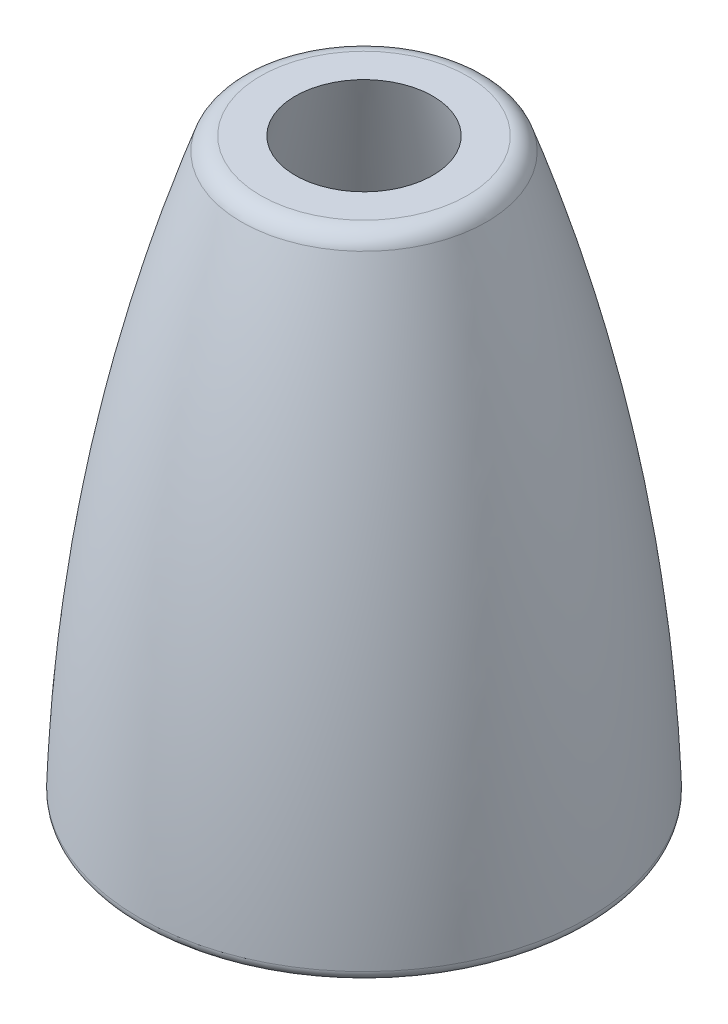
ISO-10303-21;
HEADER;
FILE_DESCRIPTION(('STEP AP214'),'2;1');
FILE_NAME('part.step','',(''),(''),'','','');
FILE_SCHEMA(('AUTOMOTIVE_DESIGN { 1 0 10303 214 1 1 1 1 }'));
ENDSEC;
DATA;
#1=APPLICATION_CONTEXT('core data for automotive mechanical design processes');
#2=APPLICATION_PROTOCOL_DEFINITION('international standard','automotive_design',2000,#1);
#3=PRODUCT_CONTEXT('',#1,'mechanical');
#4=PRODUCT('Part','Part','',(#3));
#5=PRODUCT_RELATED_PRODUCT_CATEGORY('part','',(#4));
#6=PRODUCT_DEFINITION_FORMATION('','',#4);
#7=PRODUCT_DEFINITION_CONTEXT('part definition',#1,'design');
#8=PRODUCT_DEFINITION('design','',#6,#7);
#9=PRODUCT_DEFINITION_SHAPE('','',#8);
#10=(LENGTH_UNIT() NAMED_UNIT(*) SI_UNIT(.MILLI.,.METRE.));
#11=(NAMED_UNIT(*) PLANE_ANGLE_UNIT() SI_UNIT($,.RADIAN.));
#12=(NAMED_UNIT(*) SI_UNIT($,.STERADIAN.) SOLID_ANGLE_UNIT());
#13=UNCERTAINTY_MEASURE_WITH_UNIT(LENGTH_MEASURE(1.E-05),#10,'distance_accuracy_value','');
#14=(GEOMETRIC_REPRESENTATION_CONTEXT(3) GLOBAL_UNCERTAINTY_ASSIGNED_CONTEXT((#13)) GLOBAL_UNIT_ASSIGNED_CONTEXT((#10,
#11,#12)) REPRESENTATION_CONTEXT('',''));
#15=CARTESIAN_POINT('',(0.,0.,0.));
#16=DIRECTION('',(0.,0.,1.));
#17=DIRECTION('',(1.,0.,0.));
#18=AXIS2_PLACEMENT_3D('',#15,#16,#17);
#19=CARTESIAN_POINT('',(0.,15.2,0.));
#20=DIRECTION('',(0.,-1.,0.));
#21=DIRECTION('',(0.,0.,-1.));
#22=AXIS2_PLACEMENT_3D('',#19,#20,#21);
#23=PLANE('',#22);
#24=DIRECTION('',(-0.00914718851659997,0.,0.999958163595979));
#25=VECTOR('',#24,1.);
#26=CARTESIAN_POINT('',(5.6,15.2,0.));
#27=LINE('',#26,#25);
#28=CARTESIAN_POINT('',(5.6,15.2,0.));
#29=VERTEX_POINT('',#28);
#30=CARTESIAN_POINT('',(5.59906288415433,15.2,0.102444225175011));
#31=VERTEX_POINT('',#30);
#32=EDGE_CURVE('E62',#29,#31,#27,.T.);
#33=ORIENTED_EDGE('',*,*,#32,.T.);
#34=CARTESIAN_POINT('',(0.,15.2,0.));
#35=DIRECTION('',(0.,-1.,0.));
#36=DIRECTION('',(0.,0.,-1.));
#37=AXIS2_PLACEMENT_3D('',#34,#35,#36);
#38=CIRCLE('',#37,5.59999999999999);
#39=CARTESIAN_POINT('',(-5.6,15.2,0.));
#40=VERTEX_POINT('',#39);
#41=EDGE_CURVE('E59',#31,#40,#38,.T.);
#42=ORIENTED_EDGE('',*,*,#41,.T.);
#43=DIRECTION('',(0.00919737743597815,0.,-0.999957703229642));
#44=VECTOR('',#43,1.);
#45=CARTESIAN_POINT('',(-5.6,15.2,0.));
#46=LINE('',#45,#44);
#47=CARTESIAN_POINT('',(-5.59906031348,15.2,-0.102444178140847));
#48=VERTEX_POINT('',#47);
#49=EDGE_CURVE('E19',#40,#48,#46,.T.);
#50=ORIENTED_EDGE('',*,*,#49,.T.);
#51=CARTESIAN_POINT('',(0.,15.2,0.));
#52=DIRECTION('',(0.,-1.,0.));
#53=DIRECTION('',(0.,0.,-1.));
#54=AXIS2_PLACEMENT_3D('',#51,#52,#53);
#55=CIRCLE('',#54,5.59999999999999);
#56=EDGE_CURVE('E57',#48,#29,#55,.T.);
#57=ORIENTED_EDGE('',*,*,#56,.T.);
#58=EDGE_LOOP('',(#33,#42,#50,#57));
#59=FACE_BOUND('',#58,.T.);
#60=CARTESIAN_POINT('',(0.,15.2,0.));
#61=DIRECTION('',(0.,-1.,0.));
#62=DIRECTION('',(0.,0.,-1.));
#63=AXIS2_PLACEMENT_3D('',#60,#61,#62);
#64=CIRCLE('',#63,3.525);
#65=CARTESIAN_POINT('',(0.,15.2,-3.525));
#66=VERTEX_POINT('',#65);
#67=EDGE_CURVE('E60',#66,#66,#64,.F.);
#68=ORIENTED_EDGE('',*,*,#67,.T.);
#69=EDGE_LOOP('',(#68));
#70=FACE_BOUND('',#69,.T.);
#71=ADVANCED_FACE('F15',(#59,#70),#23,.T.);
#72=CARTESIAN_POINT('',(0.,29.38420303264,0.));
#73=DIRECTION('',(0.,-1.,0.));
#74=DIRECTION('',(0.,0.,-1.));
#75=AXIS2_PLACEMENT_3D('',#72,#73,#74);
#76=CYLINDRICAL_SURFACE('',#75,3.525);
#77=ORIENTED_EDGE('',*,*,#67,.F.);
#78=EDGE_LOOP('',(#77));
#79=FACE_BOUND('',#78,.T.);
#80=CARTESIAN_POINT('',(0.,24.,0.));
#81=DIRECTION('',(0.,-1.,0.));
#82=DIRECTION('',(0.,0.,-1.));
#83=AXIS2_PLACEMENT_3D('',#80,#81,#82);
#84=CIRCLE('',#83,3.525);
#85=CARTESIAN_POINT('',(0.,24.,-3.525));
#86=VERTEX_POINT('',#85);
#87=EDGE_CURVE('E68',#86,#86,#84,.F.);
#88=ORIENTED_EDGE('',*,*,#87,.T.);
#89=EDGE_LOOP('',(#88));
#90=FACE_BOUND('',#89,.T.);
#91=ADVANCED_FACE('F157',(#79,#90),#76,.F.);
#92=CARTESIAN_POINT('',(0.,13.2,0.));
#93=DIRECTION('',(0.,-1.,0.));
#94=DIRECTION('',(0.,0.,-1.));
#95=AXIS2_PLACEMENT_3D('',#92,#93,#94);
#96=TOROIDAL_SURFACE('',#95,5.60000000000001,2.);
#97=CARTESIAN_POINT('',(0.,13.2,0.));
#98=DIRECTION('',(0.,-1.,0.));
#99=DIRECTION('',(0.,0.,-1.));
#100=AXIS2_PLACEMENT_3D('',#97,#98,#99);
#101=CIRCLE('',#100,7.6);
#102=CARTESIAN_POINT('',(0.,13.2,-7.6));
#103=VERTEX_POINT('',#102);
#104=EDGE_CURVE('E71',#103,#103,#101,.T.);
#105=ORIENTED_EDGE('',*,*,#104,.T.);
#106=EDGE_LOOP('',(#105));
#107=FACE_BOUND('',#106,.T.);
#108=ORIENTED_EDGE('',*,*,#56,.F.);
#109=ORIENTED_EDGE('',*,*,#49,.F.);
#110=ORIENTED_EDGE('',*,*,#41,.F.);
#111=ORIENTED_EDGE('',*,*,#32,.F.);
#112=EDGE_LOOP('',(#108,#109,#110,#111));
#113=FACE_BOUND('',#112,.T.);
#114=ADVANCED_FACE('F61',(#107,#113),#96,.F.);
#115=CARTESIAN_POINT('',(0.,24.,0.));
#116=DIRECTION('',(0.,-1.,0.));
#117=DIRECTION('',(0.,0.,-1.));
#118=AXIS2_PLACEMENT_3D('',#115,#116,#117);
#119=PLANE('',#118);
#120=CARTESIAN_POINT('',(0.,24.,0.));
#121=DIRECTION('',(0.,-1.,0.));
#122=DIRECTION('',(0.,0.,-1.));
#123=AXIS2_PLACEMENT_3D('',#120,#121,#122);
#124=CIRCLE('',#123,5.025);
#125=CARTESIAN_POINT('',(0.,24.,-5.025));
#126=VERTEX_POINT('',#125);
#127=EDGE_CURVE('E72',#126,#126,#124,.F.);
#128=ORIENTED_EDGE('',*,*,#127,.T.);
#129=EDGE_LOOP('',(#128));
#130=FACE_BOUND('',#129,.T.);
#131=ORIENTED_EDGE('',*,*,#87,.F.);
#132=EDGE_LOOP('',(#131));
#133=FACE_BOUND('',#132,.T.);
#134=ADVANCED_FACE('F152',(#130,#133),#119,.F.);
#135=CARTESIAN_POINT('',(0.,29.38420303264,0.));
#136=DIRECTION('',(0.,-1.,0.));
#137=DIRECTION('',(0.,0.,-1.));
#138=AXIS2_PLACEMENT_3D('',#135,#136,#137);
#139=CYLINDRICAL_SURFACE('',#138,7.6);
#140=ORIENTED_EDGE('',*,*,#104,.F.);
#141=EDGE_LOOP('',(#140));
#142=FACE_BOUND('',#141,.T.);
#143=CARTESIAN_POINT('',(0.,2.4,0.));
#144=DIRECTION('',(0.,-1.,0.));
#145=DIRECTION('',(0.,0.,-1.));
#146=AXIS2_PLACEMENT_3D('',#143,#144,#145);
#147=CIRCLE('',#146,7.6);
#148=CARTESIAN_POINT('',(0.,2.4,-7.6));
#149=VERTEX_POINT('',#148);
#150=EDGE_CURVE('E75',#149,#149,#147,.F.);
#151=ORIENTED_EDGE('',*,*,#150,.F.);
#152=EDGE_LOOP('',(#151));
#153=FACE_BOUND('',#152,.T.);
#154=ADVANCED_FACE('F148',(#142,#153),#139,.F.);
#155=CARTESIAN_POINT('',(0.,29.38420303264,0.));
#156=DIRECTION('',(0.,-1.,0.));
#157=DIRECTION('',(0.,0.,-1.));
#158=AXIS2_PLACEMENT_3D('',#155,#156,#157);
#159=CYLINDRICAL_SURFACE('',#158,5.025);
#160=ORIENTED_EDGE('',*,*,#127,.F.);
#161=EDGE_LOOP('',(#160));
#162=FACE_BOUND('',#161,.T.);
#163=CARTESIAN_POINT('',(0.,25.0000000000909,0.));
#164=DIRECTION('',(0.,-1.,0.));
#165=DIRECTION('',(0.,0.,-1.));
#166=AXIS2_PLACEMENT_3D('',#163,#164,#165);
#167=CIRCLE('',#166,5.02499999998918);
#168=CARTESIAN_POINT('',(0.,25.0000000000909,-5.02499999998918));
#169=VERTEX_POINT('',#168);
#170=EDGE_CURVE('E78',#169,#169,#167,.F.);
#171=ORIENTED_EDGE('',*,*,#170,.T.);
#172=EDGE_LOOP('',(#171));
#173=FACE_BOUND('',#172,.T.);
#174=ADVANCED_FACE('F132',(#162,#173),#159,.F.);
#175=CARTESIAN_POINT('',(0.,2.4,-21.5));
#176=DIRECTION('',(0.,-1.,0.));
#177=DIRECTION('',(0.,0.,-1.));
#178=AXIS2_PLACEMENT_3D('',#175,#176,#177);
#179=PLANE('',#178);
#180=CARTESIAN_POINT('',(-3.03576608295941E-13,2.4,2.87725843584746E-11));
#181=DIRECTION('',(0.,1.,0.));
#182=DIRECTION('',(0.,0.,1.));
#183=AXIS2_PLACEMENT_3D('',#180,#181,#182);
#184=CIRCLE('',#183,10.6542866382603);
#185=CARTESIAN_POINT('',(10.6536899184604,2.40000000000429,0.112621861908318));
#186=VERTEX_POINT('',#185);
#187=CARTESIAN_POINT('',(-10.65428663826,2.4,0.));
#188=VERTEX_POINT('',#187);
#189=EDGE_CURVE('E79',#186,#188,#184,.T.);
#190=ORIENTED_EDGE('',*,*,#189,.F.);
#191=CARTESIAN_POINT('',(-10.65428663826,2.4,0.));
#192=CARTESIAN_POINT('',(-10.6542689654252,2.39999999830858,0.143919287529837));
#193=CARTESIAN_POINT('',(-10.6513574592582,2.39999999773107,0.287843408679064));
#194=CARTESIAN_POINT('',(-10.6397446924835,2.40000000255313,0.575452835882171));
#195=CARTESIAN_POINT('',(-10.6310436312798,2.40000000795251,0.719138149990188));
#196=CARTESIAN_POINT('',(-10.6107488432834,2.40000002591153,0.970170610886358));
#197=CARTESIAN_POINT('',(-10.6004220566456,2.4000000363437,1.07762217602543));
#198=CARTESIAN_POINT('',(-10.5765691163456,2.40000014385088,1.29217199450075));
#199=CARTESIAN_POINT('',(-10.5630430012679,2.40000024092485,1.39927025208218));
#200=CARTESIAN_POINT('',(-10.535752312596,2.40000030857561,1.59092289349643));
#201=CARTESIAN_POINT('',(-10.5226133248162,2.40000030112809,1.67556731398593));
#202=CARTESIAN_POINT('',(-10.4810718321089,2.40000024267947,1.92321301128468));
#203=CARTESIAN_POINT('',(-10.4498527563828,2.4000001575678,2.08575152538939));
#204=CARTESIAN_POINT('',(-10.3846237503688,2.40000005228976,2.38727630128094));
#205=CARTESIAN_POINT('',(-10.3515649659946,2.40000002488674,2.52647001874884));
#206=CARTESIAN_POINT('',(-10.2883486349572,2.40000000196427,2.77073014982354));
#207=CARTESIAN_POINT('',(-10.2593480934118,2.40000000044585,2.8760969424706));
#208=CARTESIAN_POINT('',(-10.2032715490783,2.39999999962856,3.068392670818));
#209=CARTESIAN_POINT('',(-10.1766822462099,2.40000000000152,3.15546366099328));
#210=CARTESIAN_POINT('',(-10.1212742313736,2.40000000053643,3.32889135840802));
#211=CARTESIAN_POINT('',(-10.0924555225762,2.40000000069838,3.41524806666308));
#212=CARTESIAN_POINT('',(-10.0026970386529,2.40000000135446,3.67316629896762));
#213=CARTESIAN_POINT('',(-9.93845063392781,2.40000000201884,3.84359058201102));
#214=CARTESIAN_POINT('',(-9.80131387731575,2.40000000307656,4.18091500733054));
#215=CARTESIAN_POINT('',(-9.72842353771891,2.4000000034699,4.34781515461696));
#216=CARTESIAN_POINT('',(-9.57418876683898,2.40000000386674,4.67766494088835));
#217=CARTESIAN_POINT('',(-9.49284433955938,2.40000000387024,4.84061458174408));
#218=CARTESIAN_POINT('',(-9.32191540324746,2.40000000346465,5.16213249971454));
#219=CARTESIAN_POINT('',(-9.23233089030359,2.40000000305557,5.32070077474941));
#220=CARTESIAN_POINT('',(-9.04515641883491,2.40000000203542,5.63304070655637));
#221=CARTESIAN_POINT('',(-8.94756644891892,2.40000000142435,5.78681235650279));
#222=CARTESIAN_POINT('',(-8.74463865936752,2.40000000040542,6.08915477896542));
#223=CARTESIAN_POINT('',(-8.63930082136096,2.39999999999756,6.23772553914845));
#224=CARTESIAN_POINT('',(-8.41020711726413,2.40000000000269,6.54390032354204));
#225=CARTESIAN_POINT('',(-8.28566366259152,2.40000000050213,6.70091550779718));
#226=CARTESIAN_POINT('',(-8.0245635434954,2.4000000020686,7.01166508144463));
#227=CARTESIAN_POINT('',(-7.88777887686231,2.40000000315004,7.16520833740024));
#228=CARTESIAN_POINT('',(-7.67479101851897,2.40000000494652,7.39079700050716));
#229=CARTESIAN_POINT('',(-7.60177810882471,2.40000000558113,7.4658794371768));
#230=CARTESIAN_POINT('',(-7.4526470609581,2.4000000068793,7.61478060303627));
#231=CARTESIAN_POINT('',(-7.37650161345749,2.40000000754313,7.68857204267664));
#232=CARTESIAN_POINT('',(-7.2210945686466,2.40000000886775,7.83473956862671));
#233=CARTESIAN_POINT('',(-7.14180619840818,2.40000000952841,7.90708717467028));
#234=CARTESIAN_POINT('',(-6.9801049225498,2.40000001081896,8.05021586278085));
#235=CARTESIAN_POINT('',(-6.89766579162835,2.40000001144838,8.12096732297199));
#236=CARTESIAN_POINT('',(-6.72966198850291,2.4000000126523,8.26074781647359));
#237=CARTESIAN_POINT('',(-6.64407170732765,2.40000001322605,8.32974607068237));
#238=CARTESIAN_POINT('',(-6.4697710814335,2.40000001429818,8.4658611868031));
#239=CARTESIAN_POINT('',(-6.38103579891656,2.4000000147956,8.53294611727492));
#240=CARTESIAN_POINT('',(-6.20045780221209,2.40000001569834,8.66507237939187));
#241=CARTESIAN_POINT('',(-6.10859088151632,2.40000001610253,8.73008062982968));
#242=CARTESIAN_POINT('',(-5.92176963588495,2.40000001680581,8.85788843957988));
#243=CARTESIAN_POINT('',(-5.82679189585519,2.40000001710363,8.92065377447998));
#244=CARTESIAN_POINT('',(-5.63377678980184,2.40000001758488,9.04380801520357));
#245=CARTESIAN_POINT('',(-5.53571686153046,2.40000001776696,9.10416156241783));
#246=CARTESIAN_POINT('',(-5.33657322732413,2.40000001801114,9.22232214694561));
#247=CARTESIAN_POINT('',(-5.23546787424722,2.40000001807186,9.28009270347657));
#248=CARTESIAN_POINT('',(-5.03027763116661,2.40000001807147,9.39291520059263));
#249=CARTESIAN_POINT('',(-4.92617207220108,2.40000001800899,9.4479295532585));
#250=CARTESIAN_POINT('',(-4.71503436328771,2.40000001776403,9.55506585758364));
#251=CARTESIAN_POINT('',(-4.60798258629679,2.40000001758024,9.60714913238561));
#252=CARTESIAN_POINT('',(-4.39101439717269,2.40000001709826,9.70824818850018));
#253=CARTESIAN_POINT('',(-4.28107946419287,2.40000001679883,9.75722422548242));
#254=CARTESIAN_POINT('',(-4.05841622285273,2.40000001609488,9.85193280435814));
#255=CARTESIAN_POINT('',(-3.94567056451431,2.40000001568925,9.89762455929158));
#256=CARTESIAN_POINT('',(-3.71746671809562,2.40000001478591,9.98558808839484));
#257=CARTESIAN_POINT('',(-3.60199241582189,2.40000001428727,10.0278180613017));
#258=CARTESIAN_POINT('',(-3.36842198050451,2.40000001321465,10.1086815085291));
#259=CARTESIAN_POINT('',(-3.25031103404552,2.40000001263994,10.1472721991937));
#260=CARTESIAN_POINT('',(-3.01156811569287,2.40000001143568,10.2206810111957));
#261=CARTESIAN_POINT('',(-2.89092269607751,2.40000001080561,10.2554554020755));
#262=CARTESIAN_POINT('',(-2.64722197223107,2.40000000951486,10.3210564959765));
#263=CARTESIAN_POINT('',(-2.52415465056554,2.40000000885391,10.3518385610883));
#264=CARTESIAN_POINT('',(-2.27573183046901,2.40000000752934,10.409281373211));
#265=CARTESIAN_POINT('',(-2.1503658092037,2.40000000686575,10.4358966180933));
#266=CARTESIAN_POINT('',(-1.8974779890401,2.40000000556757,10.4848341948264));
#267=CARTESIAN_POINT('',(-1.76994722486463,2.40000000493334,10.5071102073588));
#268=CARTESIAN_POINT('',(-1.51287343186185,2.40000000372925,10.5472003921));
#269=CARTESIAN_POINT('',(-1.3833230599813,2.40000000316012,10.5649674792923));
#270=CARTESIAN_POINT('',(-1.12236385196942,2.40000000212543,10.5958739874785));
#271=CARTESIAN_POINT('',(-0.990949348874298,2.40000000166097,10.608965611514));
#272=CARTESIAN_POINT('',(-0.726429741988141,2.40000000087828,10.6303597767161));
#273=CARTESIAN_POINT('',(-0.593320736252382,2.40000000056154,10.638613873501));
#274=CARTESIAN_POINT('',(-0.32558025454125,2.4000000001218,10.6501740923384));
#275=CARTESIAN_POINT('',(-0.190946592522561,2.40000000000072,10.6534311662041));
#276=CARTESIAN_POINT('',(-0.0470284588738655,2.39999999999995,10.6541865442615));
#277=CARTESIAN_POINT('',(-0.0377444618552427,2.40000000000047,10.6542231453236));
#278=CARTESIAN_POINT('',(-0.0189736752545771,2.40000000000061,10.654273174296));
#279=CARTESIAN_POINT('',(-0.00948688460339239,2.4000000000002,10.6542860786969));
#280=CARTESIAN_POINT('',(0.191013888883362,2.39999999999809,10.6542910328116));
#281=CARTESIAN_POINT('',(0.382065865956335,2.40000000011982,10.6491593505252));
#282=CARTESIAN_POINT('',(0.763596773054154,2.40000000056937,10.6286303474993));
#283=CARTESIAN_POINT('',(0.954075702099103,2.40000000089718,10.6132330092158));
#284=CARTESIAN_POINT('',(1.34128028737617,2.40000000172442,10.5714259642177));
#285=CARTESIAN_POINT('',(1.53796279719374,2.40000000222999,10.5446135831903));
#286=CARTESIAN_POINT('',(1.92952143768506,2.40000000336103,10.4800470497553));
#287=CARTESIAN_POINT('',(2.12439756563847,2.40000000398649,10.4422928808724));
#288=CARTESIAN_POINT('',(2.51173827947328,2.40000000531231,10.3559606841277));
#289=CARTESIAN_POINT('',(2.70420286205415,2.40000000601268,10.3073826414536));
#290=CARTESIAN_POINT('',(3.08611894087873,2.40000000744787,10.1995542580399));
#291=CARTESIAN_POINT('',(3.27557043341227,2.40000000818269,10.14030390416));
#292=CARTESIAN_POINT('',(3.6508692382591,2.40000000965055,10.0113158094691));
#293=CARTESIAN_POINT('',(3.83671654662911,2.40000001038358,9.94157805718461));
#294=CARTESIAN_POINT('',(4.20422685751157,2.4000000118159,9.79183280306576));
#295=CARTESIAN_POINT('',(4.38588985602035,2.40000001251518,9.71182529140541));
#296=CARTESIAN_POINT('',(4.74446455646986,2.40000001385233,9.54179021538459));
#297=CARTESIAN_POINT('',(4.9213762545165,2.4000000144902,9.45176264281212));
#298=CARTESIAN_POINT('',(5.26989617296175,2.4000000156811,9.26196841850885));
#299=CARTESIAN_POINT('',(5.44150438974156,2.40000001623413,9.16220176013281));
#300=CARTESIAN_POINT('',(5.77888172351382,2.40000001723625,8.95324073829535));
#301=CARTESIAN_POINT('',(5.94465083732331,2.40000001768533,8.84404636969491));
#302=CARTESIAN_POINT('',(6.26983256719389,2.40000001846469,8.61657072979846));
#303=CARTESIAN_POINT('',(6.4292451806623,2.40000001879496,8.49828945479618));
#304=CARTESIAN_POINT('',(6.74121635308807,2.40000001932612,8.25300916901855));
#305=CARTESIAN_POINT('',(6.89377491019043,2.40000001952701,8.12601015588383));
#306=CARTESIAN_POINT('',(7.19156180707351,2.40000001979311,7.86369077287557));
#307=CARTESIAN_POINT('',(7.33679014587629,2.40000001985832,7.72837040189188));
#308=CARTESIAN_POINT('',(7.61946332388734,2.40000001985103,7.44983065697628));
#309=CARTESIAN_POINT('',(7.75690816312532,2.40000001977853,7.30661128307452));
#310=CARTESIAN_POINT('',(8.02358535526072,2.40000001949807,7.01272054241503));
#311=CARTESIAN_POINT('',(8.15281770931649,2.40000001929011,6.86204917670838));
#312=CARTESIAN_POINT('',(8.40266657904466,2.40000001874527,6.55372472340272));
#313=CARTESIAN_POINT('',(8.52328309711465,2.40000001840838,6.39607163774658));
#314=CARTESIAN_POINT('',(8.75552383669356,2.40000001761648,6.07427580832816));
#315=CARTESIAN_POINT('',(8.86714806193882,2.40000001716147,5.9101330672624));
#316=CARTESIAN_POINT('',(9.08105582665245,2.4000000161484,5.57587024754151));
#317=CARTESIAN_POINT('',(9.18333937128372,2.40000001559034,5.40575017219033));
#318=CARTESIAN_POINT('',(9.37824654237508,2.40000001439053,5.06006366184002));
#319=CARTESIAN_POINT('',(9.47087017550015,2.40000001374878,4.88449723059878));
#320=CARTESIAN_POINT('',(9.64616844336396,2.40000001240522,4.52846598618357));
#321=CARTESIAN_POINT('',(9.72884308633243,2.4000000117034,4.34800117706165));
#322=CARTESIAN_POINT('',(9.88398535257184,2.40000001026762,3.98273644401866));
#323=CARTESIAN_POINT('',(9.95645298568663,2.40000000953366,3.79793652427867));
#324=CARTESIAN_POINT('',(10.0909550590335,2.40000000806575,3.42457836709743));
#325=CARTESIAN_POINT('',(10.1529895107593,2.40000000733181,3.23602013379679));
#326=CARTESIAN_POINT('',(10.2664316627028,2.40000000590042,2.85573387996979));
#327=CARTESIAN_POINT('',(10.3178393760859,2.40000000520297,2.66400586337074));
#328=CARTESIAN_POINT('',(10.4098674858571,2.40000000388528,2.27797845453466));
#329=CARTESIAN_POINT('',(10.4504878970899,2.40000000326503,2.08367906583651));
#330=CARTESIAN_POINT('',(10.52081517327,2.40000000214683,1.69311539349087));
#331=CARTESIAN_POINT('',(10.5505220547331,2.40000000164886,1.49685111281741));
#332=CARTESIAN_POINT('',(10.5989276302434,2.40000000082426,1.10297010376945));
#333=CARTESIAN_POINT('',(10.6176263424604,2.40000000049763,0.905353377627839));
#334=CARTESIAN_POINT('',(10.6439645479174,2.40000000007014,0.509384760559068));
#335=CARTESIAN_POINT('',(10.6516040609293,2.3999999999693,0.311032870946887));
#336=CARTESIAN_POINT('',(10.6536884539806,2.40000000000858,0.112621846399577));
#337=B_SPLINE_CURVE_WITH_KNOTS('',3,(#191,#192,#193,#194,#195,#196,#197,#198,#199,#200,#201,
#202,#203,#204,#205,#206,#207,#208,#209,#210,#211,#212,#213,#214,#215,#216,#217,#218,#219,#220,
#221,#222,#223,#224,#225,#226,#227,#228,#229,#230,#231,#232,#233,#234,#235,#236,#237,#238,#239,
#240,#241,#242,#243,#244,#245,#246,#247,#248,#249,#250,#251,#252,#253,#254,#255,#256,#257,#258,
#259,#260,#261,#262,#263,#264,#265,#266,#267,#268,#269,#270,#271,#272,#273,#274,#275,#276,#277,
#278,#279,#280,#281,#282,#283,#284,#285,#286,#287,#288,#289,#290,#291,#292,#293,#294,#295,#296,
#297,#298,#299,#300,#301,#302,#303,#304,#305,#306,#307,#308,#309,#310,#311,#312,#313,#314,#315,
#316,#317,#318,#319,#320,#321,#322,#323,#324,#325,#326,#327,#328,#329,#330,#331,#332,#333,#334,
#335,#336),.UNSPECIFIED.,.F.,.F.,(4,2,2,2,2,2,2,2,2,2,2,2,2,2,2,2,2,2,2,2,2,2,2,2,2,2,2,2,2,2,2,
2,2,2,2,2,2,2,2,2,2,2,2,2,2,2,2,2,2,2,2,2,2,2,2,2,2,2,2,2,2,2,2,2,2,2,2,2,2,2,2,2,4),(0.,
0.431738984942221,0.863463100688874,1.18725872471448,1.51105044388004,1.7680036281368,
2.26433094141186,2.69341494362834,3.02121974758522,3.29431064740003,3.56740115885592,
4.11353645101099,4.65967096666832,5.20580522370128,5.75193973998333,6.29807503338784,
6.84421162178822,7.44513204955969,8.06166015323436,8.37581105823764,8.69386495801826,
9.01582180951017,9.34168156800898,9.67144418717206,10.0051096190185,10.3426778139291,
10.6841487206466,11.0295222862753,11.3787984562814,11.7319771744931,12.0890583831002,
12.4500420226545,12.8149280320698,13.1837163486214,13.556406907947,13.9329996440459,
14.3134944892794,14.697891374371,15.0861902284058,15.4783909788312,15.8744935514566,
16.2744978704531,16.6784038583544,16.706256088868,16.7347165554273,17.307754451861,
17.8807933276188,18.4759829075216,19.0711733836132,19.6663646742154,20.2615566976498,
20.8567493722382,21.4519426163022,22.0471363481634,22.6423304861438,23.2375249485648,
23.8327196537482,24.4279145200158,25.0231094656892,25.6183044090901,26.2134992685402,
26.8086939623612,27.4038884088748,27.9990825264027,28.5942762332667,29.1894694477883,
29.7846620882893,30.3798540730915,30.9750453205164,31.5702357488858,32.1654252765214,
32.7606138217448,33.3558013028778),.UNSPECIFIED.);
#338=EDGE_CURVE('E82',#188,#186,#337,.T.);
#339=ORIENTED_EDGE('',*,*,#338,.F.);
#340=EDGE_LOOP('',(#190,#339));
#341=FACE_BOUND('',#340,.T.);
#342=ORIENTED_EDGE('',*,*,#150,.T.);
#343=EDGE_LOOP('',(#342));
#344=FACE_BOUND('',#343,.T.);
#345=ADVANCED_FACE('F136',(#341,#344),#179,.T.);
#346=CARTESIAN_POINT('',(0.,25.0000000001478,0.));
#347=DIRECTION('',(0.,-1.,0.));
#348=DIRECTION('',(0.,0.,-1.));
#349=AXIS2_PLACEMENT_3D('',#346,#347,#348);
#350=CONICAL_SURFACE('',#349,5.02499999996076,0.261977344229614);
#351=ORIENTED_EDGE('',*,*,#170,.F.);
#352=EDGE_LOOP('',(#351));
#353=FACE_BOUND('',#352,.T.);
#354=CARTESIAN_POINT('',(0.,30.9999999999491,0.));
#355=DIRECTION('',(0.,-1.,0.));
#356=DIRECTION('',(0.,0.,-1.));
#357=AXIS2_PLACEMENT_3D('',#354,#355,#356);
#358=CIRCLE('',#357,3.41616039207999);
#359=CARTESIAN_POINT('',(0.,30.9999999999491,-3.41616039207999));
#360=VERTEX_POINT('',#359);
#361=EDGE_CURVE('E81',#360,#360,#358,.T.);
#362=ORIENTED_EDGE('',*,*,#361,.F.);
#363=EDGE_LOOP('',(#362));
#364=FACE_BOUND('',#363,.T.);
#365=ADVANCED_FACE('F113',(#353,#364),#350,.F.);
#366=CARTESIAN_POINT('',(0.,31.,0.));
#367=DIRECTION('',(0.,1.,0.));
#368=DIRECTION('',(0.,0.,1.));
#369=AXIS2_PLACEMENT_3D('',#366,#367,#368);
#370=PLANE('',#369);
#371=CARTESIAN_POINT('',(0.,31.,0.));
#372=DIRECTION('',(0.,1.,0.));
#373=DIRECTION('',(0.,0.,1.));
#374=AXIS2_PLACEMENT_3D('',#371,#372,#373);
#375=CIRCLE('',#374,5.142709066435);
#376=CARTESIAN_POINT('',(5.142709066435,31.,0.));
#377=VERTEX_POINT('',#376);
#378=CARTESIAN_POINT('',(5.14246453578035,31.,-0.0501036575441729));
#379=VERTEX_POINT('',#378);
#380=EDGE_CURVE('E33',#377,#379,#375,.F.);
#381=ORIENTED_EDGE('',*,*,#380,.F.);
#382=DIRECTION('',(-0.00488948651745629,0.,-0.999988046389353));
#383=VECTOR('',#382,1.);
#384=CARTESIAN_POINT('',(5.142709066435,31.,0.));
#385=LINE('',#384,#383);
#386=EDGE_CURVE('E85',#377,#379,#385,.T.);
#387=ORIENTED_EDGE('',*,*,#386,.T.);
#388=EDGE_LOOP('',(#381,#387));
#389=FACE_BOUND('',#388,.T.);
#390=ORIENTED_EDGE('',*,*,#361,.T.);
#391=EDGE_LOOP('',(#390));
#392=FACE_BOUND('',#391,.T.);
#393=ADVANCED_FACE('F103',(#389,#392),#370,.T.);
#394=CARTESIAN_POINT('',(0.,2.9,0.));
#395=DIRECTION('',(0.,1.,0.));
#396=DIRECTION('',(0.,0.,1.));
#397=AXIS2_PLACEMENT_3D('',#394,#395,#396);
#398=TOROIDAL_SURFACE('',#397,10.6542866382582,0.500000000001796);
#399=ORIENTED_EDGE('',*,*,#338,.T.);
#400=ORIENTED_EDGE('',*,*,#189,.T.);
#401=EDGE_LOOP('',(#399,#400));
#402=FACE_BOUND('',#401,.T.);
#403=CARTESIAN_POINT('',(0.,2.91575931232105,-3.97425148346287E-12));
#404=DIRECTION('',(0.,1.,0.));
#405=DIRECTION('',(0.,0.,1.));
#406=AXIS2_PLACEMENT_3D('',#403,#404,#405);
#407=CIRCLE('',#406,11.1540382206321);
#408=CARTESIAN_POINT('',(0.,2.91575931232105,11.1540382206282));
#409=VERTEX_POINT('',#408);
#410=EDGE_CURVE('E25',#409,#409,#407,.T.);
#411=ORIENTED_EDGE('',*,*,#410,.F.);
#412=EDGE_LOOP('',(#411));
#413=FACE_BOUND('',#412,.T.);
#414=ADVANCED_FACE('F101',(#402,#413),#398,.T.);
#415=CARTESIAN_POINT('',(0.,30.,0.));
#416=DIRECTION('',(0.,1.,0.));
#417=DIRECTION('',(0.,0.,1.));
#418=AXIS2_PLACEMENT_3D('',#415,#416,#417);
#419=TOROIDAL_SURFACE('',#418,5.14270906643501,0.999999999999994);
#420=CARTESIAN_POINT('',(0.,30.3278362805497,-3.97425148346287E-12));
#421=DIRECTION('',(0.,1.,0.));
#422=DIRECTION('',(0.,0.,1.));
#423=AXIS2_PLACEMENT_3D('',#420,#421,#422);
#424=CIRCLE('',#423,6.08744361812104);
#425=CARTESIAN_POINT('',(0.,30.3278362805497,6.08744361811707));
#426=VERTEX_POINT('',#425);
#427=EDGE_CURVE('E10',#426,#426,#424,.F.);
#428=ORIENTED_EDGE('',*,*,#427,.F.);
#429=EDGE_LOOP('',(#428));
#430=FACE_BOUND('',#429,.T.);
#431=ORIENTED_EDGE('',*,*,#380,.T.);
#432=ORIENTED_EDGE('',*,*,#386,.F.);
#433=EDGE_LOOP('',(#431,#432));
#434=FACE_BOUND('',#433,.T.);
#435=ADVANCED_FACE('F17',(#430,#434),#419,.T.);
#436=CARTESIAN_POINT('',(0.,-5.39746199124114E-11,-81.3090909092635));
#437=DIRECTION('',(1.,0.,0.));
#438=DIRECTION('',(0.,0.,1.));
#439=AXIS2_PLACEMENT_3D('',#436,#437,#438);
#440=CIRCLE('',#439,92.5090909092654);
#441=TRIMMED_CURVE('',#440,(PARAMETER_VALUE(-0.497180488659357)),
(PARAMETER_VALUE(0.497180488659357)),.T.,.PARAMETER.);
#442=CARTESIAN_POINT('',(0.,-5.39746199124114E-11,-3.97425148346287E-12));
#443=DIRECTION('',(0.,1.,0.));
#444=AXIS1_PLACEMENT('',#442,#443);
#445=SURFACE_OF_REVOLUTION('',#441,#444);
#446=ORIENTED_EDGE('',*,*,#427,.T.);
#447=EDGE_LOOP('',(#446));
#448=FACE_BOUND('',#447,.T.);
#449=ORIENTED_EDGE('',*,*,#410,.T.);
#450=EDGE_LOOP('',(#449));
#451=FACE_BOUND('',#450,.T.);
#452=ADVANCED_FACE('F111',(#448,#451),#445,.F.);
#453=CLOSED_SHELL('',(#71,#91,#114,#134,#154,#174,#345,#365,#393,#414,#435,#452));
#454=MANIFOLD_SOLID_BREP('B1',#453);
#455=ADVANCED_BREP_SHAPE_REPRESENTATION('',(#18,#454),#14);
#456=SHAPE_DEFINITION_REPRESENTATION(#9,#455);
ENDSEC;
END-ISO-10303-21;
